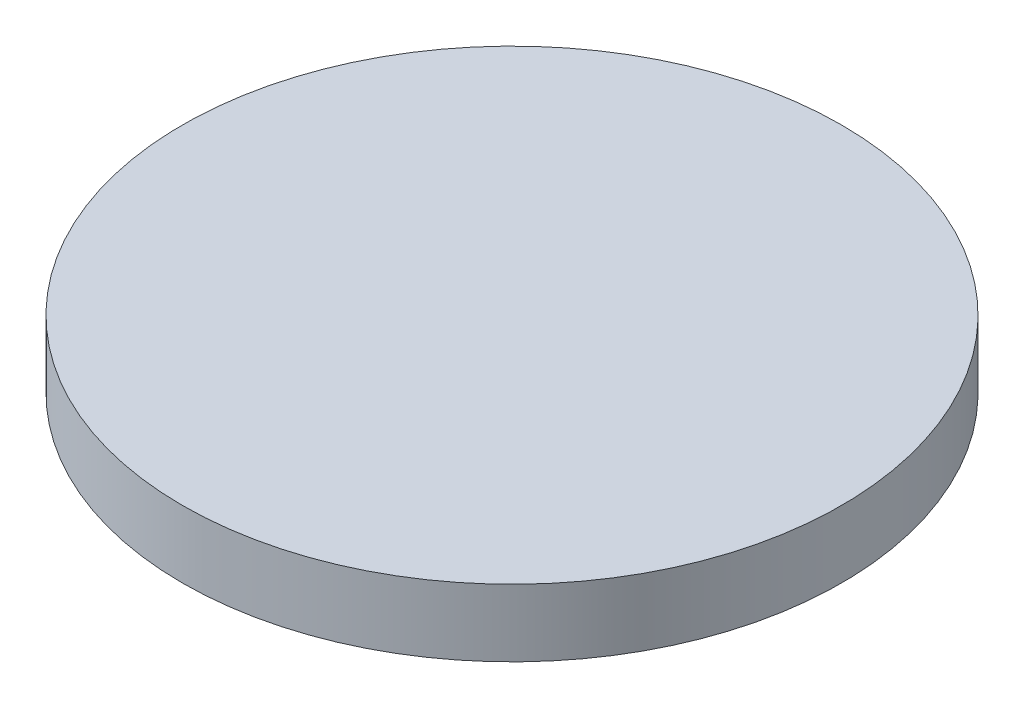
ISO-10303-21;
HEADER;
FILE_DESCRIPTION(('STEP AP214'),'2;1');
FILE_NAME('part.step','',(''),(''),'','','');
FILE_SCHEMA(('AUTOMOTIVE_DESIGN { 1 0 10303 214 1 1 1 1 }'));
ENDSEC;
DATA;
#1=APPLICATION_CONTEXT('core data for automotive mechanical design processes');
#2=APPLICATION_PROTOCOL_DEFINITION('international standard','automotive_design',2000,#1);
#3=PRODUCT_CONTEXT('',#1,'mechanical');
#4=PRODUCT('Part','Part','',(#3));
#5=PRODUCT_RELATED_PRODUCT_CATEGORY('part','',(#4));
#6=PRODUCT_DEFINITION_FORMATION('','',#4);
#7=PRODUCT_DEFINITION_CONTEXT('part definition',#1,'design');
#8=PRODUCT_DEFINITION('design','',#6,#7);
#9=PRODUCT_DEFINITION_SHAPE('','',#8);
#10=(LENGTH_UNIT() NAMED_UNIT(*) SI_UNIT(.MILLI.,.METRE.));
#11=(NAMED_UNIT(*) PLANE_ANGLE_UNIT() SI_UNIT($,.RADIAN.));
#12=(NAMED_UNIT(*) SI_UNIT($,.STERADIAN.) SOLID_ANGLE_UNIT());
#13=UNCERTAINTY_MEASURE_WITH_UNIT(LENGTH_MEASURE(1.E-05),#10,'distance_accuracy_value','');
#14=(GEOMETRIC_REPRESENTATION_CONTEXT(3) GLOBAL_UNCERTAINTY_ASSIGNED_CONTEXT((#13)) GLOBAL_UNIT_ASSIGNED_CONTEXT((#10,
#11,#12)) REPRESENTATION_CONTEXT('',''));
#15=CARTESIAN_POINT('',(0.,0.,0.));
#16=DIRECTION('',(0.,0.,1.));
#17=DIRECTION('',(1.,0.,0.));
#18=AXIS2_PLACEMENT_3D('',#15,#16,#17);
#19=CARTESIAN_POINT('',(0.,1000.,0.));
#20=DIRECTION('',(0.,-1.,0.));
#21=DIRECTION('',(0.,0.,-1.));
#22=AXIS2_PLACEMENT_3D('',#19,#20,#21);
#23=CYLINDRICAL_SURFACE('',#22,9805.);
#24=CARTESIAN_POINT('',(0.,1000.,0.));
#25=DIRECTION('',(0.,1.,0.));
#26=DIRECTION('',(0.,0.,1.));
#27=AXIS2_PLACEMENT_3D('',#24,#25,#26);
#28=CIRCLE('',#27,9805.);
#29=CARTESIAN_POINT('',(0.,1000.,9805.));
#30=VERTEX_POINT('',#29);
#31=EDGE_CURVE('E10',#30,#30,#28,.T.);
#32=ORIENTED_EDGE('',*,*,#31,.F.);
#33=EDGE_LOOP('',(#32));
#34=FACE_BOUND('',#33,.T.);
#35=CARTESIAN_POINT('',(0.,-1000.,0.));
#36=DIRECTION('',(0.,1.,0.));
#37=DIRECTION('',(0.,0.,1.));
#38=AXIS2_PLACEMENT_3D('',#35,#36,#37);
#39=CIRCLE('',#38,9805.);
#40=CARTESIAN_POINT('',(0.,-1000.,9805.));
#41=VERTEX_POINT('',#40);
#42=EDGE_CURVE('E38',#41,#41,#39,.T.);
#43=ORIENTED_EDGE('',*,*,#42,.T.);
#44=EDGE_LOOP('',(#43));
#45=FACE_BOUND('',#44,.T.);
#46=ADVANCED_FACE('F35',(#34,#45),#23,.T.);
#47=CARTESIAN_POINT('',(0.,1000.,0.));
#48=DIRECTION('',(0.,1.,0.));
#49=DIRECTION('',(0.,0.,1.));
#50=AXIS2_PLACEMENT_3D('',#47,#48,#49);
#51=PLANE('',#50);
#52=ORIENTED_EDGE('',*,*,#31,.T.);
#53=EDGE_LOOP('',(#52));
#54=FACE_BOUND('',#53,.T.);
#55=ADVANCED_FACE('F50',(#54),#51,.T.);
#56=CARTESIAN_POINT('',(0.,-1000.,0.));
#57=DIRECTION('',(0.,1.,0.));
#58=DIRECTION('',(0.,0.,1.));
#59=AXIS2_PLACEMENT_3D('',#56,#57,#58);
#60=PLANE('',#59);
#61=ORIENTED_EDGE('',*,*,#42,.F.);
#62=EDGE_LOOP('',(#61));
#63=FACE_BOUND('',#62,.T.);
#64=ADVANCED_FACE('F48',(#63),#60,.F.);
#65=CLOSED_SHELL('',(#46,#55,#64));
#66=MANIFOLD_SOLID_BREP('B2',#65);
#67=ADVANCED_BREP_SHAPE_REPRESENTATION('',(#18,#66),#14);
#68=SHAPE_DEFINITION_REPRESENTATION(#9,#67);
ENDSEC;
END-ISO-10303-21;
